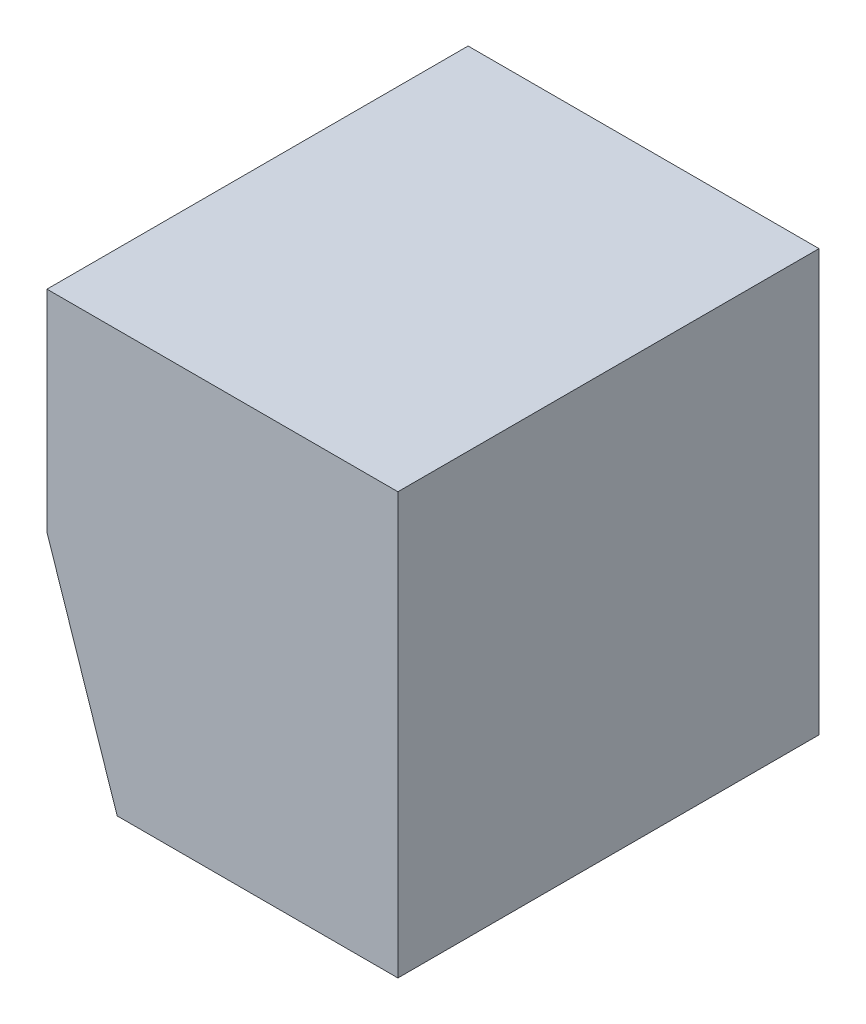
ISO-10303-21;
HEADER;
FILE_DESCRIPTION(('STEP AP214'),'2;1');
FILE_NAME('part.step','',(''),(''),'','','');
FILE_SCHEMA(('AUTOMOTIVE_DESIGN { 1 0 10303 214 1 1 1 1 }'));
ENDSEC;
DATA;
#1=APPLICATION_CONTEXT('core data for automotive mechanical design processes');
#2=APPLICATION_PROTOCOL_DEFINITION('international standard','automotive_design',2000,#1);
#3=PRODUCT_CONTEXT('',#1,'mechanical');
#4=PRODUCT('Part','Part','',(#3));
#5=PRODUCT_RELATED_PRODUCT_CATEGORY('part','',(#4));
#6=PRODUCT_DEFINITION_FORMATION('','',#4);
#7=PRODUCT_DEFINITION_CONTEXT('part definition',#1,'design');
#8=PRODUCT_DEFINITION('design','',#6,#7);
#9=PRODUCT_DEFINITION_SHAPE('','',#8);
#10=(LENGTH_UNIT() NAMED_UNIT(*) SI_UNIT(.MILLI.,.METRE.));
#11=(NAMED_UNIT(*) PLANE_ANGLE_UNIT() SI_UNIT($,.RADIAN.));
#12=(NAMED_UNIT(*) SI_UNIT($,.STERADIAN.) SOLID_ANGLE_UNIT());
#13=UNCERTAINTY_MEASURE_WITH_UNIT(LENGTH_MEASURE(1.E-05),#10,'distance_accuracy_value','');
#14=(GEOMETRIC_REPRESENTATION_CONTEXT(3) GLOBAL_UNCERTAINTY_ASSIGNED_CONTEXT((#13)) GLOBAL_UNIT_ASSIGNED_CONTEXT((#10,
#11,#12)) REPRESENTATION_CONTEXT('',''));
#15=CARTESIAN_POINT('',(0.,0.,0.));
#16=DIRECTION('',(0.,0.,1.));
#17=DIRECTION('',(1.,0.,0.));
#18=AXIS2_PLACEMENT_3D('',#15,#16,#17);
#19=CARTESIAN_POINT('',(25.,0.,30.));
#20=DIRECTION('',(0.,-1.,0.));
#21=DIRECTION('',(1.,0.,0.));
#22=AXIS2_PLACEMENT_3D('',#19,#20,#21);
#23=PLANE('',#22);
#24=DIRECTION('',(-1.,0.,0.));
#25=VECTOR('',#24,1.);
#26=CARTESIAN_POINT('',(25.,0.,0.));
#27=LINE('',#26,#25);
#28=CARTESIAN_POINT('',(25.,0.,0.));
#29=VERTEX_POINT('',#28);
#30=CARTESIAN_POINT('',(0.,0.,0.));
#31=VERTEX_POINT('',#30);
#32=EDGE_CURVE('E109',#29,#31,#27,.T.);
#33=ORIENTED_EDGE('',*,*,#32,.T.);
#34=DIRECTION('',(0.,0.,-1.));
#35=VECTOR('',#34,1.);
#36=CARTESIAN_POINT('',(0.,0.,30.));
#37=LINE('',#36,#35);
#38=CARTESIAN_POINT('',(0.,0.,30.));
#39=VERTEX_POINT('',#38);
#40=EDGE_CURVE('E11',#39,#31,#37,.T.);
#41=ORIENTED_EDGE('',*,*,#40,.F.);
#42=DIRECTION('',(-1.,0.,0.));
#43=VECTOR('',#42,1.);
#44=CARTESIAN_POINT('',(25.,0.,30.));
#45=LINE('',#44,#43);
#46=CARTESIAN_POINT('',(25.,0.,30.));
#47=VERTEX_POINT('',#46);
#48=EDGE_CURVE('E117',#47,#39,#45,.T.);
#49=ORIENTED_EDGE('',*,*,#48,.F.);
#50=DIRECTION('',(0.,0.,-1.));
#51=VECTOR('',#50,1.);
#52=CARTESIAN_POINT('',(25.,0.,30.));
#53=LINE('',#52,#51);
#54=EDGE_CURVE('E105',#47,#29,#53,.T.);
#55=ORIENTED_EDGE('',*,*,#54,.T.);
#56=EDGE_LOOP('',(#33,#41,#49,#55));
#57=FACE_BOUND('',#56,.T.);
#58=ADVANCED_FACE('F35',(#57),#23,.F.);
#59=CARTESIAN_POINT('',(0.,0.,30.));
#60=DIRECTION('',(1.,0.,0.));
#61=DIRECTION('',(0.,1.,0.));
#62=AXIS2_PLACEMENT_3D('',#59,#60,#61);
#63=PLANE('',#62);
#64=DIRECTION('',(0.,-1.,0.));
#65=VECTOR('',#64,1.);
#66=CARTESIAN_POINT('',(0.,0.,0.));
#67=LINE('',#66,#65);
#68=CARTESIAN_POINT('',(0.,-15.,0.));
#69=VERTEX_POINT('',#68);
#70=EDGE_CURVE('E112',#31,#69,#67,.T.);
#71=ORIENTED_EDGE('',*,*,#70,.T.);
#72=DIRECTION('',(0.,0.,-1.));
#73=VECTOR('',#72,1.);
#74=CARTESIAN_POINT('',(0.,-15.,30.));
#75=LINE('',#74,#73);
#76=CARTESIAN_POINT('',(0.,-15.,30.));
#77=VERTEX_POINT('',#76);
#78=EDGE_CURVE('E43',#77,#69,#75,.T.);
#79=ORIENTED_EDGE('',*,*,#78,.F.);
#80=DIRECTION('',(0.,-1.,0.));
#81=VECTOR('',#80,1.);
#82=CARTESIAN_POINT('',(0.,0.,30.));
#83=LINE('',#82,#81);
#84=EDGE_CURVE('E85',#39,#77,#83,.T.);
#85=ORIENTED_EDGE('',*,*,#84,.F.);
#86=ORIENTED_EDGE('',*,*,#40,.T.);
#87=EDGE_LOOP('',(#71,#79,#85,#86));
#88=FACE_BOUND('',#87,.T.);
#89=ADVANCED_FACE('F136',(#88),#63,.F.);
#90=CARTESIAN_POINT('',(0.,-15.,30.));
#91=DIRECTION('',(0.948683298050514,0.316227766016838,0.));
#92=DIRECTION('',(-0.316227766016838,0.948683298050514,0.));
#93=AXIS2_PLACEMENT_3D('',#90,#91,#92);
#94=PLANE('',#93);
#95=DIRECTION('',(0.316227766016838,-0.948683298050514,0.));
#96=VECTOR('',#95,1.);
#97=CARTESIAN_POINT('',(0.,-15.,0.));
#98=LINE('',#97,#96);
#99=CARTESIAN_POINT('',(5.,-30.,0.));
#100=VERTEX_POINT('',#99);
#101=EDGE_CURVE('E100',#69,#100,#98,.T.);
#102=ORIENTED_EDGE('',*,*,#101,.T.);
#103=DIRECTION('',(0.,0.,-1.));
#104=VECTOR('',#103,1.);
#105=CARTESIAN_POINT('',(5.,-30.,30.));
#106=LINE('',#105,#104);
#107=CARTESIAN_POINT('',(5.,-30.,30.));
#108=VERTEX_POINT('',#107);
#109=EDGE_CURVE('E97',#108,#100,#106,.T.);
#110=ORIENTED_EDGE('',*,*,#109,.F.);
#111=DIRECTION('',(0.316227766016838,-0.948683298050514,0.));
#112=VECTOR('',#111,1.);
#113=CARTESIAN_POINT('',(0.,-15.,30.));
#114=LINE('',#113,#112);
#115=EDGE_CURVE('E89',#77,#108,#114,.T.);
#116=ORIENTED_EDGE('',*,*,#115,.F.);
#117=ORIENTED_EDGE('',*,*,#78,.T.);
#118=EDGE_LOOP('',(#102,#110,#116,#117));
#119=FACE_BOUND('',#118,.T.);
#120=ADVANCED_FACE('F98',(#119),#94,.F.);
#121=CARTESIAN_POINT('',(5.,-30.,30.));
#122=DIRECTION('',(0.,1.,0.));
#123=DIRECTION('',(0.,0.,1.));
#124=AXIS2_PLACEMENT_3D('',#121,#122,#123);
#125=PLANE('',#124);
#126=DIRECTION('',(1.,0.,0.));
#127=VECTOR('',#126,1.);
#128=CARTESIAN_POINT('',(5.,-30.,0.));
#129=LINE('',#128,#127);
#130=CARTESIAN_POINT('',(25.,-30.,0.));
#131=VERTEX_POINT('',#130);
#132=EDGE_CURVE('E71',#100,#131,#129,.T.);
#133=ORIENTED_EDGE('',*,*,#132,.T.);
#134=DIRECTION('',(0.,0.,-1.));
#135=VECTOR('',#134,1.);
#136=CARTESIAN_POINT('',(25.,-30.,30.));
#137=LINE('',#136,#135);
#138=CARTESIAN_POINT('',(25.,-30.,30.));
#139=VERTEX_POINT('',#138);
#140=EDGE_CURVE('E101',#139,#131,#137,.T.);
#141=ORIENTED_EDGE('',*,*,#140,.F.);
#142=DIRECTION('',(1.,0.,0.));
#143=VECTOR('',#142,1.);
#144=CARTESIAN_POINT('',(5.,-30.,30.));
#145=LINE('',#144,#143);
#146=EDGE_CURVE('E93',#108,#139,#145,.T.);
#147=ORIENTED_EDGE('',*,*,#146,.F.);
#148=ORIENTED_EDGE('',*,*,#109,.T.);
#149=EDGE_LOOP('',(#133,#141,#147,#148));
#150=FACE_BOUND('',#149,.T.);
#151=ADVANCED_FACE('F103',(#150),#125,.F.);
#152=CARTESIAN_POINT('',(25.,-30.,30.));
#153=DIRECTION('',(-1.,0.,0.));
#154=DIRECTION('',(0.,0.,1.));
#155=AXIS2_PLACEMENT_3D('',#152,#153,#154);
#156=PLANE('',#155);
#157=DIRECTION('',(0.,1.,0.));
#158=VECTOR('',#157,1.);
#159=CARTESIAN_POINT('',(25.,-30.,0.));
#160=LINE('',#159,#158);
#161=EDGE_CURVE('E77',#131,#29,#160,.T.);
#162=ORIENTED_EDGE('',*,*,#161,.T.);
#163=ORIENTED_EDGE('',*,*,#54,.F.);
#164=DIRECTION('',(0.,1.,0.));
#165=VECTOR('',#164,1.);
#166=CARTESIAN_POINT('',(25.,-30.,30.));
#167=LINE('',#166,#165);
#168=EDGE_CURVE('E51',#139,#47,#167,.T.);
#169=ORIENTED_EDGE('',*,*,#168,.F.);
#170=ORIENTED_EDGE('',*,*,#140,.T.);
#171=EDGE_LOOP('',(#162,#163,#169,#170));
#172=FACE_BOUND('',#171,.T.);
#173=ADVANCED_FACE('F125',(#172),#156,.F.);
#174=CARTESIAN_POINT('',(0.,0.,30.));
#175=DIRECTION('',(0.,0.,1.));
#176=DIRECTION('',(1.,0.,0.));
#177=AXIS2_PLACEMENT_3D('',#174,#175,#176);
#178=PLANE('',#177);
#179=ORIENTED_EDGE('',*,*,#48,.T.);
#180=ORIENTED_EDGE('',*,*,#84,.T.);
#181=ORIENTED_EDGE('',*,*,#115,.T.);
#182=ORIENTED_EDGE('',*,*,#146,.T.);
#183=ORIENTED_EDGE('',*,*,#168,.T.);
#184=EDGE_LOOP('',(#179,#180,#181,#182,#183));
#185=FACE_BOUND('',#184,.T.);
#186=ADVANCED_FACE('F91',(#185),#178,.T.);
#187=CARTESIAN_POINT('',(0.,0.,0.));
#188=DIRECTION('',(0.,0.,1.));
#189=DIRECTION('',(1.,0.,0.));
#190=AXIS2_PLACEMENT_3D('',#187,#188,#189);
#191=PLANE('',#190);
#192=ORIENTED_EDGE('',*,*,#32,.F.);
#193=ORIENTED_EDGE('',*,*,#161,.F.);
#194=ORIENTED_EDGE('',*,*,#132,.F.);
#195=ORIENTED_EDGE('',*,*,#101,.F.);
#196=ORIENTED_EDGE('',*,*,#70,.F.);
#197=EDGE_LOOP('',(#192,#193,#194,#195,#196));
#198=FACE_BOUND('',#197,.T.);
#199=ADVANCED_FACE('F121',(#198),#191,.F.);
#200=CLOSED_SHELL('',(#58,#89,#120,#151,#173,#186,#199));
#201=MANIFOLD_SOLID_BREP('B2',#200);
#202=ADVANCED_BREP_SHAPE_REPRESENTATION('',(#18,#201),#14);
#203=SHAPE_DEFINITION_REPRESENTATION(#9,#202);
ENDSEC;
END-ISO-10303-21;
